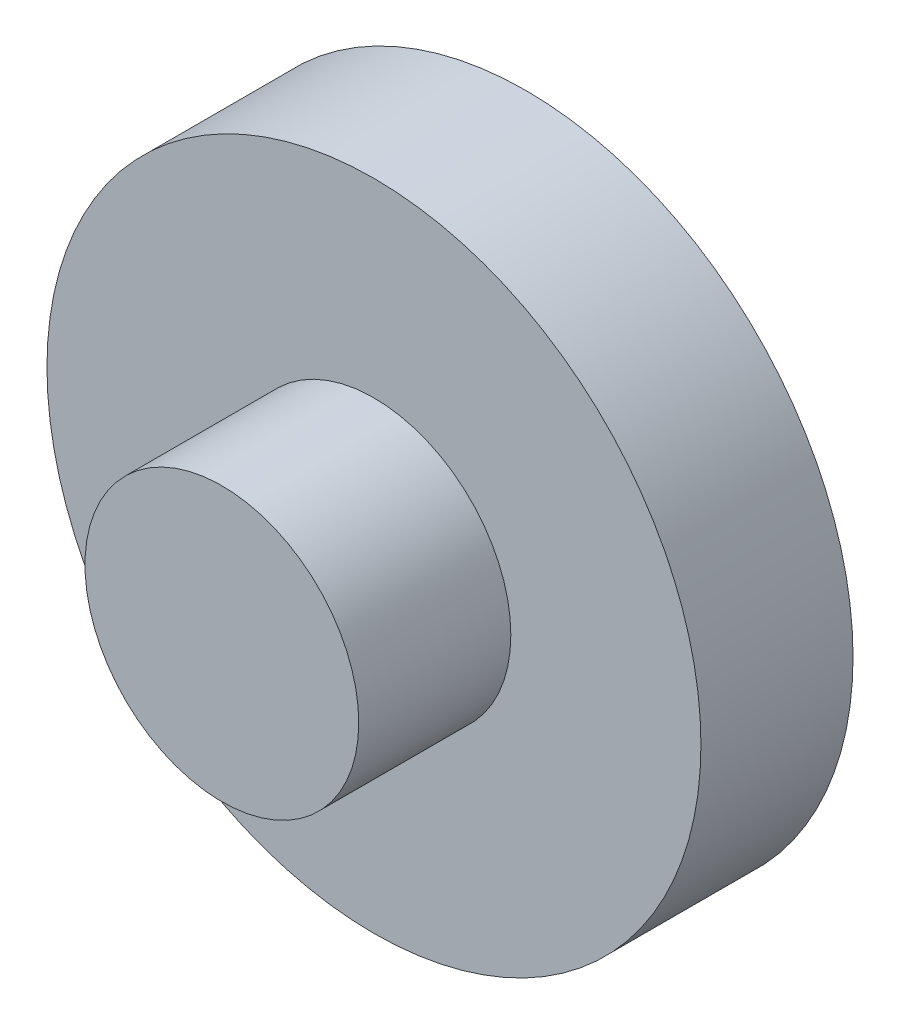
ISO-10303-21;
HEADER;
FILE_DESCRIPTION(('STEP AP214'),'2;1');
FILE_NAME('part.step','',(''),(''),'','','');
FILE_SCHEMA(('AUTOMOTIVE_DESIGN { 1 0 10303 214 1 1 1 1 }'));
ENDSEC;
DATA;
#1=APPLICATION_CONTEXT('core data for automotive mechanical design processes');
#2=APPLICATION_PROTOCOL_DEFINITION('international standard','automotive_design',2000,#1);
#3=PRODUCT_CONTEXT('',#1,'mechanical');
#4=PRODUCT('Part','Part','',(#3));
#5=PRODUCT_RELATED_PRODUCT_CATEGORY('part','',(#4));
#6=PRODUCT_DEFINITION_FORMATION('','',#4);
#7=PRODUCT_DEFINITION_CONTEXT('part definition',#1,'design');
#8=PRODUCT_DEFINITION('design','',#6,#7);
#9=PRODUCT_DEFINITION_SHAPE('','',#8);
#10=(LENGTH_UNIT() NAMED_UNIT(*) SI_UNIT(.MILLI.,.METRE.));
#11=(NAMED_UNIT(*) PLANE_ANGLE_UNIT() SI_UNIT($,.RADIAN.));
#12=(NAMED_UNIT(*) SI_UNIT($,.STERADIAN.) SOLID_ANGLE_UNIT());
#13=UNCERTAINTY_MEASURE_WITH_UNIT(LENGTH_MEASURE(1.E-05),#10,'distance_accuracy_value','');
#14=(GEOMETRIC_REPRESENTATION_CONTEXT(3) GLOBAL_UNCERTAINTY_ASSIGNED_CONTEXT((#13)) GLOBAL_UNIT_ASSIGNED_CONTEXT((#10,
#11,#12)) REPRESENTATION_CONTEXT('',''));
#15=CARTESIAN_POINT('',(0.,0.,0.));
#16=DIRECTION('',(0.,0.,1.));
#17=DIRECTION('',(1.,0.,0.));
#18=AXIS2_PLACEMENT_3D('',#15,#16,#17);
#19=CARTESIAN_POINT('',(0.,0.,2.54));
#20=DIRECTION('',(0.,0.,-1.));
#21=DIRECTION('',(-1.,0.,0.));
#22=AXIS2_PLACEMENT_3D('',#19,#20,#21);
#23=CYLINDRICAL_SURFACE('',#22,5.461);
#24=CARTESIAN_POINT('',(0.,0.,2.54));
#25=DIRECTION('',(0.,0.,1.));
#26=DIRECTION('',(1.,0.,0.));
#27=AXIS2_PLACEMENT_3D('',#24,#25,#26);
#28=CIRCLE('',#27,5.461);
#29=CARTESIAN_POINT('',(5.461,0.,2.54));
#30=VERTEX_POINT('',#29);
#31=EDGE_CURVE('E38',#30,#30,#28,.T.);
#32=ORIENTED_EDGE('',*,*,#31,.F.);
#33=EDGE_LOOP('',(#32));
#34=FACE_BOUND('',#33,.T.);
#35=CARTESIAN_POINT('',(0.,0.,0.));
#36=DIRECTION('',(0.,0.,1.));
#37=DIRECTION('',(1.,0.,0.));
#38=AXIS2_PLACEMENT_3D('',#35,#36,#37);
#39=CIRCLE('',#38,5.461);
#40=CARTESIAN_POINT('',(5.461,0.,0.));
#41=VERTEX_POINT('',#40);
#42=EDGE_CURVE('E34',#41,#41,#39,.T.);
#43=ORIENTED_EDGE('',*,*,#42,.T.);
#44=EDGE_LOOP('',(#43));
#45=FACE_BOUND('',#44,.T.);
#46=ADVANCED_FACE('F31',(#34,#45),#23,.T.);
#47=CARTESIAN_POINT('',(0.,0.,2.54));
#48=DIRECTION('',(0.,0.,1.));
#49=DIRECTION('',(1.,0.,0.));
#50=AXIS2_PLACEMENT_3D('',#47,#48,#49);
#51=PLANE('',#50);
#52=CARTESIAN_POINT('',(0.,0.,2.54));
#53=DIRECTION('',(0.,0.,1.));
#54=DIRECTION('',(1.,0.,0.));
#55=AXIS2_PLACEMENT_3D('',#52,#53,#54);
#56=CIRCLE('',#55,2.286);
#57=CARTESIAN_POINT('',(2.286,0.,2.54));
#58=VERTEX_POINT('',#57);
#59=EDGE_CURVE('E10',#58,#58,#56,.T.);
#60=ORIENTED_EDGE('',*,*,#59,.F.);
#61=EDGE_LOOP('',(#60));
#62=FACE_BOUND('',#61,.T.);
#63=ORIENTED_EDGE('',*,*,#31,.T.);
#64=EDGE_LOOP('',(#63));
#65=FACE_BOUND('',#64,.T.);
#66=ADVANCED_FACE('F55',(#62,#65),#51,.T.);
#67=CARTESIAN_POINT('',(0.,0.,0.));
#68=DIRECTION('',(0.,0.,1.));
#69=DIRECTION('',(1.,0.,0.));
#70=AXIS2_PLACEMENT_3D('',#67,#68,#69);
#71=PLANE('',#70);
#72=ORIENTED_EDGE('',*,*,#42,.F.);
#73=EDGE_LOOP('',(#72));
#74=FACE_BOUND('',#73,.T.);
#75=ADVANCED_FACE('F52',(#74),#71,.F.);
#76=CARTESIAN_POINT('',(0.,0.,5.08));
#77=DIRECTION('',(0.,0.,-1.));
#78=DIRECTION('',(-1.,0.,0.));
#79=AXIS2_PLACEMENT_3D('',#76,#77,#78);
#80=CYLINDRICAL_SURFACE('',#79,2.286);
#81=CARTESIAN_POINT('',(0.,0.,5.08));
#82=DIRECTION('',(0.,0.,1.));
#83=DIRECTION('',(1.,0.,0.));
#84=AXIS2_PLACEMENT_3D('',#81,#82,#83);
#85=CIRCLE('',#84,2.286);
#86=CARTESIAN_POINT('',(2.286,0.,5.08));
#87=VERTEX_POINT('',#86);
#88=EDGE_CURVE('E44',#87,#87,#85,.T.);
#89=ORIENTED_EDGE('',*,*,#88,.F.);
#90=EDGE_LOOP('',(#89));
#91=FACE_BOUND('',#90,.T.);
#92=ORIENTED_EDGE('',*,*,#59,.T.);
#93=EDGE_LOOP('',(#92));
#94=FACE_BOUND('',#93,.T.);
#95=ADVANCED_FACE('F54',(#91,#94),#80,.T.);
#96=CARTESIAN_POINT('',(0.,0.,5.08));
#97=DIRECTION('',(0.,0.,1.));
#98=DIRECTION('',(1.,0.,0.));
#99=AXIS2_PLACEMENT_3D('',#96,#97,#98);
#100=PLANE('',#99);
#101=ORIENTED_EDGE('',*,*,#88,.T.);
#102=EDGE_LOOP('',(#101));
#103=FACE_BOUND('',#102,.T.);
#104=ADVANCED_FACE('F60',(#103),#100,.T.);
#105=CLOSED_SHELL('',(#46,#66,#75,#95,#104));
#106=MANIFOLD_SOLID_BREP('B2',#105);
#107=ADVANCED_BREP_SHAPE_REPRESENTATION('',(#18,#106),#14);
#108=SHAPE_DEFINITION_REPRESENTATION(#9,#107);
ENDSEC;
END-ISO-10303-21;
